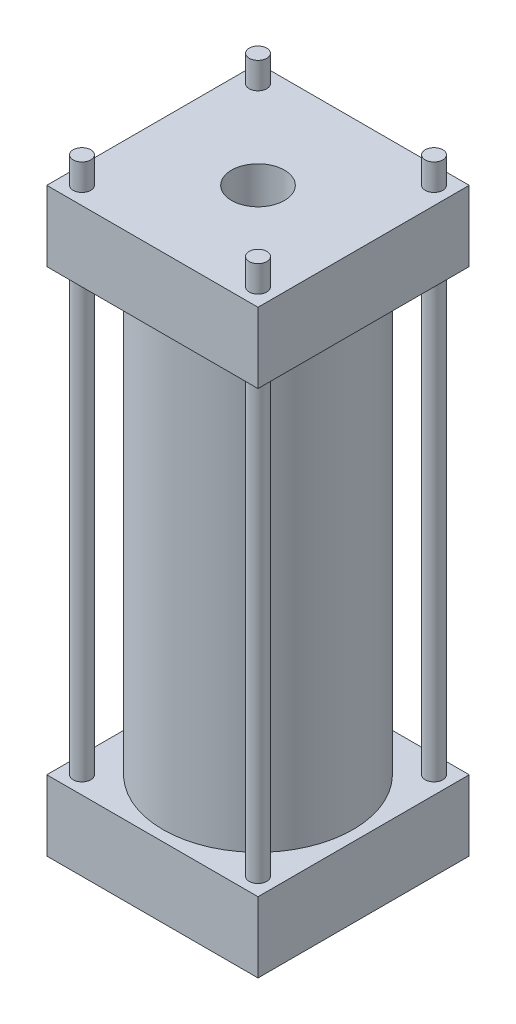
ISO-10303-21;
HEADER;
FILE_DESCRIPTION(('STEP AP214'),'2;1');
FILE_NAME('part.step','',(''),(''),'','','');
FILE_SCHEMA(('AUTOMOTIVE_DESIGN { 1 0 10303 214 1 1 1 1 }'));
ENDSEC;
DATA;
#1=APPLICATION_CONTEXT('core data for automotive mechanical design processes');
#2=APPLICATION_PROTOCOL_DEFINITION('international standard','automotive_design',2000,#1);
#3=PRODUCT_CONTEXT('',#1,'mechanical');
#4=PRODUCT('Part','Part','',(#3));
#5=PRODUCT_RELATED_PRODUCT_CATEGORY('part','',(#4));
#6=PRODUCT_DEFINITION_FORMATION('','',#4);
#7=PRODUCT_DEFINITION_CONTEXT('part definition',#1,'design');
#8=PRODUCT_DEFINITION('design','',#6,#7);
#9=PRODUCT_DEFINITION_SHAPE('','',#8);
#10=(LENGTH_UNIT() NAMED_UNIT(*) SI_UNIT(.MILLI.,.METRE.));
#11=(NAMED_UNIT(*) PLANE_ANGLE_UNIT() SI_UNIT($,.RADIAN.));
#12=(NAMED_UNIT(*) SI_UNIT($,.STERADIAN.) SOLID_ANGLE_UNIT());
#13=UNCERTAINTY_MEASURE_WITH_UNIT(LENGTH_MEASURE(1.E-05),#10,'distance_accuracy_value','');
#14=(GEOMETRIC_REPRESENTATION_CONTEXT(3) GLOBAL_UNCERTAINTY_ASSIGNED_CONTEXT((#13)) GLOBAL_UNIT_ASSIGNED_CONTEXT((#10,
#11,#12)) REPRESENTATION_CONTEXT('',''));
#15=CARTESIAN_POINT('',(0.,0.,0.));
#16=DIRECTION('',(0.,0.,1.));
#17=DIRECTION('',(1.,0.,0.));
#18=AXIS2_PLACEMENT_3D('',#15,#16,#17);
#19=CARTESIAN_POINT('',(0.,0.,0.));
#20=DIRECTION('',(0.,1.,0.));
#21=DIRECTION('',(0.,0.,1.));
#22=AXIS2_PLACEMENT_3D('',#19,#20,#21);
#23=PLANE('',#22);
#24=CARTESIAN_POINT('',(0.,0.,0.));
#25=DIRECTION('',(0.,1.,0.));
#26=DIRECTION('',(0.,0.,1.));
#27=AXIS2_PLACEMENT_3D('',#24,#25,#26);
#28=CIRCLE('',#27,50.);
#29=CARTESIAN_POINT('',(0.,0.,50.));
#30=VERTEX_POINT('',#29);
#31=EDGE_CURVE('E166',#30,#30,#28,.T.);
#32=ORIENTED_EDGE('',*,*,#31,.T.);
#33=EDGE_LOOP('',(#32));
#34=FACE_BOUND('',#33,.T.);
#35=ADVANCED_FACE('F32',(#34),#23,.T.);
#36=CARTESIAN_POINT('',(0.,250.,0.));
#37=DIRECTION('',(0.,-1.,0.));
#38=DIRECTION('',(0.,0.,-1.));
#39=AXIS2_PLACEMENT_3D('',#36,#37,#38);
#40=CYLINDRICAL_SURFACE('',#39,50.);
#41=CARTESIAN_POINT('',(0.,250.,0.));
#42=DIRECTION('',(0.,1.,0.));
#43=DIRECTION('',(0.,0.,1.));
#44=AXIS2_PLACEMENT_3D('',#41,#42,#43);
#45=CIRCLE('',#44,50.);
#46=CARTESIAN_POINT('',(0.,250.,50.));
#47=VERTEX_POINT('',#46);
#48=EDGE_CURVE('E134',#47,#47,#45,.T.);
#49=ORIENTED_EDGE('',*,*,#48,.T.);
#50=EDGE_LOOP('',(#49));
#51=FACE_BOUND('',#50,.T.);
#52=ORIENTED_EDGE('',*,*,#31,.F.);
#53=EDGE_LOOP('',(#52));
#54=FACE_BOUND('',#53,.T.);
#55=ADVANCED_FACE('F237',(#51,#54),#40,.F.);
#56=CARTESIAN_POINT('',(0.,250.,0.));
#57=DIRECTION('',(0.,1.,0.));
#58=DIRECTION('',(0.,0.,1.));
#59=AXIS2_PLACEMENT_3D('',#56,#57,#58);
#60=PLANE('',#59);
#61=CARTESIAN_POINT('',(0.,250.,0.));
#62=DIRECTION('',(0.,1.,0.));
#63=DIRECTION('',(0.,0.,1.));
#64=AXIS2_PLACEMENT_3D('',#61,#62,#63);
#65=CIRCLE('',#64,15.);
#66=CARTESIAN_POINT('',(0.,250.,15.));
#67=VERTEX_POINT('',#66);
#68=EDGE_CURVE('E205',#67,#67,#65,.F.);
#69=ORIENTED_EDGE('',*,*,#68,.F.);
#70=EDGE_LOOP('',(#69));
#71=FACE_BOUND('',#70,.T.);
#72=ORIENTED_EDGE('',*,*,#48,.F.);
#73=EDGE_LOOP('',(#72));
#74=FACE_BOUND('',#73,.T.);
#75=ADVANCED_FACE('F244',(#71,#74),#60,.F.);
#76=CARTESIAN_POINT('',(0.,-40.001,0.));
#77=DIRECTION('',(0.,1.,0.));
#78=DIRECTION('',(0.,0.,1.));
#79=AXIS2_PLACEMENT_3D('',#76,#77,#78);
#80=CYLINDRICAL_SURFACE('',#79,15.);
#81=CARTESIAN_POINT('',(0.,290.,0.));
#82=DIRECTION('',(0.,1.,0.));
#83=DIRECTION('',(0.,0.,1.));
#84=AXIS2_PLACEMENT_3D('',#81,#82,#83);
#85=CIRCLE('',#84,15.);
#86=CARTESIAN_POINT('',(0.,290.,15.));
#87=VERTEX_POINT('',#86);
#88=EDGE_CURVE('E200',#87,#87,#85,.T.);
#89=ORIENTED_EDGE('',*,*,#88,.T.);
#90=EDGE_LOOP('',(#89));
#91=FACE_BOUND('',#90,.T.);
#92=ORIENTED_EDGE('',*,*,#68,.T.);
#93=EDGE_LOOP('',(#92));
#94=FACE_BOUND('',#93,.T.);
#95=ADVANCED_FACE('F258',(#91,#94),#80,.F.);
#96=CARTESIAN_POINT('',(0.,250.,0.));
#97=DIRECTION('',(0.,-1.,0.));
#98=DIRECTION('',(0.,0.,-1.));
#99=AXIS2_PLACEMENT_3D('',#96,#97,#98);
#100=CYLINDRICAL_SURFACE('',#99,54.);
#101=CARTESIAN_POINT('',(0.,250.,0.));
#102=DIRECTION('',(0.,1.,0.));
#103=DIRECTION('',(0.,0.,1.));
#104=AXIS2_PLACEMENT_3D('',#101,#102,#103);
#105=CIRCLE('',#104,54.);
#106=CARTESIAN_POINT('',(0.,250.,54.));
#107=VERTEX_POINT('',#106);
#108=EDGE_CURVE('E169',#107,#107,#105,.T.);
#109=ORIENTED_EDGE('',*,*,#108,.F.);
#110=EDGE_LOOP('',(#109));
#111=FACE_BOUND('',#110,.T.);
#112=CARTESIAN_POINT('',(0.,0.,0.));
#113=DIRECTION('',(0.,1.,0.));
#114=DIRECTION('',(0.,0.,1.));
#115=AXIS2_PLACEMENT_3D('',#112,#113,#114);
#116=CIRCLE('',#115,54.);
#117=CARTESIAN_POINT('',(0.,0.,54.));
#118=VERTEX_POINT('',#117);
#119=EDGE_CURVE('E163',#118,#118,#116,.T.);
#120=ORIENTED_EDGE('',*,*,#119,.T.);
#121=EDGE_LOOP('',(#120));
#122=FACE_BOUND('',#121,.T.);
#123=ADVANCED_FACE('F34',(#111,#122),#100,.T.);
#124=CARTESIAN_POINT('',(50.,0.,50.));
#125=DIRECTION('',(0.,1.,0.));
#126=DIRECTION('',(0.,0.,1.));
#127=AXIS2_PLACEMENT_3D('',#124,#125,#126);
#128=CIRCLE('',#127,5.);
#129=CARTESIAN_POINT('',(50.,0.,55.));
#130=VERTEX_POINT('',#129);
#131=EDGE_CURVE('E11',#130,#130,#128,.T.);
#132=ORIENTED_EDGE('',*,*,#131,.F.);
#133=EDGE_LOOP('',(#132));
#134=FACE_BOUND('',#133,.T.);
#135=CARTESIAN_POINT('',(50.,0.,-50.));
#136=DIRECTION('',(0.,1.,0.));
#137=DIRECTION('',(0.,0.,1.));
#138=AXIS2_PLACEMENT_3D('',#135,#136,#137);
#139=CIRCLE('',#138,5.);
#140=CARTESIAN_POINT('',(50.,0.,-45.));
#141=VERTEX_POINT('',#140);
#142=EDGE_CURVE('E181',#141,#141,#139,.T.);
#143=ORIENTED_EDGE('',*,*,#142,.F.);
#144=EDGE_LOOP('',(#143));
#145=FACE_BOUND('',#144,.T.);
#146=CARTESIAN_POINT('',(-50.,0.,50.));
#147=DIRECTION('',(0.,1.,0.));
#148=DIRECTION('',(0.,0.,1.));
#149=AXIS2_PLACEMENT_3D('',#146,#147,#148);
#150=CIRCLE('',#149,5.);
#151=CARTESIAN_POINT('',(-50.,0.,55.));
#152=VERTEX_POINT('',#151);
#153=EDGE_CURVE('E178',#152,#152,#150,.T.);
#154=ORIENTED_EDGE('',*,*,#153,.F.);
#155=EDGE_LOOP('',(#154));
#156=FACE_BOUND('',#155,.T.);
#157=CARTESIAN_POINT('',(-50.,0.,-50.));
#158=DIRECTION('',(0.,1.,0.));
#159=DIRECTION('',(0.,0.,1.));
#160=AXIS2_PLACEMENT_3D('',#157,#158,#159);
#161=CIRCLE('',#160,5.);
#162=CARTESIAN_POINT('',(-50.,0.,-45.));
#163=VERTEX_POINT('',#162);
#164=EDGE_CURVE('E175',#163,#163,#161,.T.);
#165=ORIENTED_EDGE('',*,*,#164,.F.);
#166=EDGE_LOOP('',(#165));
#167=FACE_BOUND('',#166,.T.);
#168=DIRECTION('',(0.,0.,-1.));
#169=VECTOR('',#168,1.);
#170=CARTESIAN_POINT('',(-60.,0.,60.));
#171=LINE('',#170,#169);
#172=CARTESIAN_POINT('',(-60.,0.,60.));
#173=VERTEX_POINT('',#172);
#174=CARTESIAN_POINT('',(-60.,0.,-60.));
#175=VERTEX_POINT('',#174);
#176=EDGE_CURVE('E137',#173,#175,#171,.T.);
#177=ORIENTED_EDGE('',*,*,#176,.F.);
#178=DIRECTION('',(-1.,0.,0.));
#179=VECTOR('',#178,1.);
#180=CARTESIAN_POINT('',(60.,0.,60.));
#181=LINE('',#180,#179);
#182=CARTESIAN_POINT('',(60.,0.,60.));
#183=VERTEX_POINT('',#182);
#184=EDGE_CURVE('E74',#183,#173,#181,.T.);
#185=ORIENTED_EDGE('',*,*,#184,.F.);
#186=DIRECTION('',(0.,0.,1.));
#187=VECTOR('',#186,1.);
#188=CARTESIAN_POINT('',(60.,0.,60.));
#189=LINE('',#188,#187);
#190=CARTESIAN_POINT('',(60.,0.,-60.));
#191=VERTEX_POINT('',#190);
#192=EDGE_CURVE('E68',#191,#183,#189,.T.);
#193=ORIENTED_EDGE('',*,*,#192,.F.);
#194=DIRECTION('',(1.,0.,0.));
#195=VECTOR('',#194,1.);
#196=CARTESIAN_POINT('',(60.,0.,-60.));
#197=LINE('',#196,#195);
#198=EDGE_CURVE('E152',#175,#191,#197,.T.);
#199=ORIENTED_EDGE('',*,*,#198,.F.);
#200=EDGE_LOOP('',(#177,#185,#193,#199));
#201=FACE_BOUND('',#200,.T.);
#202=ORIENTED_EDGE('',*,*,#119,.F.);
#203=EDGE_LOOP('',(#202));
#204=FACE_BOUND('',#203,.T.);
#205=ADVANCED_FACE('F240',(#134,#145,#156,#167,#201,#204),#23,.T.);
#206=CARTESIAN_POINT('',(-60.,-40.,60.));
#207=DIRECTION('',(1.,0.,0.));
#208=DIRECTION('',(0.,0.,-1.));
#209=AXIS2_PLACEMENT_3D('',#206,#207,#208);
#210=PLANE('',#209);
#211=ORIENTED_EDGE('',*,*,#176,.T.);
#212=DIRECTION('',(0.,1.,0.));
#213=VECTOR('',#212,1.);
#214=CARTESIAN_POINT('',(-60.,-40.,-60.));
#215=LINE('',#214,#213);
#216=CARTESIAN_POINT('',(-60.,-40.,-60.));
#217=VERTEX_POINT('',#216);
#218=EDGE_CURVE('E161',#217,#175,#215,.T.);
#219=ORIENTED_EDGE('',*,*,#218,.F.);
#220=DIRECTION('',(0.,0.,-1.));
#221=VECTOR('',#220,1.);
#222=CARTESIAN_POINT('',(-60.,-40.,60.));
#223=LINE('',#222,#221);
#224=CARTESIAN_POINT('',(-60.,-40.,60.));
#225=VERTEX_POINT('',#224);
#226=EDGE_CURVE('E143',#225,#217,#223,.T.);
#227=ORIENTED_EDGE('',*,*,#226,.F.);
#228=DIRECTION('',(0.,1.,0.));
#229=VECTOR('',#228,1.);
#230=CARTESIAN_POINT('',(-60.,-40.,60.));
#231=LINE('',#230,#229);
#232=EDGE_CURVE('E149',#225,#173,#231,.T.);
#233=ORIENTED_EDGE('',*,*,#232,.T.);
#234=EDGE_LOOP('',(#211,#219,#227,#233));
#235=FACE_BOUND('',#234,.T.);
#236=ADVANCED_FACE('F249',(#235),#210,.F.);
#237=CARTESIAN_POINT('',(60.,-40.,-60.));
#238=DIRECTION('',(0.,0.,1.));
#239=DIRECTION('',(1.,0.,0.));
#240=AXIS2_PLACEMENT_3D('',#237,#238,#239);
#241=PLANE('',#240);
#242=ORIENTED_EDGE('',*,*,#198,.T.);
#243=DIRECTION('',(0.,1.,0.));
#244=VECTOR('',#243,1.);
#245=CARTESIAN_POINT('',(60.,-40.,-60.));
#246=LINE('',#245,#244);
#247=CARTESIAN_POINT('',(60.,-40.,-60.));
#248=VERTEX_POINT('',#247);
#249=EDGE_CURVE('E159',#248,#191,#246,.T.);
#250=ORIENTED_EDGE('',*,*,#249,.F.);
#251=DIRECTION('',(1.,0.,0.));
#252=VECTOR('',#251,1.);
#253=CARTESIAN_POINT('',(60.,-40.,-60.));
#254=LINE('',#253,#252);
#255=EDGE_CURVE('E82',#217,#248,#254,.T.);
#256=ORIENTED_EDGE('',*,*,#255,.F.);
#257=ORIENTED_EDGE('',*,*,#218,.T.);
#258=EDGE_LOOP('',(#242,#250,#256,#257));
#259=FACE_BOUND('',#258,.T.);
#260=ADVANCED_FACE('F255',(#259),#241,.F.);
#261=CARTESIAN_POINT('',(60.,-40.,60.));
#262=DIRECTION('',(-1.,0.,0.));
#263=DIRECTION('',(0.,0.,1.));
#264=AXIS2_PLACEMENT_3D('',#261,#262,#263);
#265=PLANE('',#264);
#266=ORIENTED_EDGE('',*,*,#192,.T.);
#267=DIRECTION('',(0.,1.,0.));
#268=VECTOR('',#267,1.);
#269=CARTESIAN_POINT('',(60.,-40.,60.));
#270=LINE('',#269,#268);
#271=CARTESIAN_POINT('',(60.,-40.,60.));
#272=VERTEX_POINT('',#271);
#273=EDGE_CURVE('E157',#272,#183,#270,.T.);
#274=ORIENTED_EDGE('',*,*,#273,.F.);
#275=DIRECTION('',(0.,0.,1.));
#276=VECTOR('',#275,1.);
#277=CARTESIAN_POINT('',(60.,-40.,60.));
#278=LINE('',#277,#276);
#279=EDGE_CURVE('E146',#248,#272,#278,.T.);
#280=ORIENTED_EDGE('',*,*,#279,.F.);
#281=ORIENTED_EDGE('',*,*,#249,.T.);
#282=EDGE_LOOP('',(#266,#274,#280,#281));
#283=FACE_BOUND('',#282,.T.);
#284=ADVANCED_FACE('F275',(#283),#265,.F.);
#285=CARTESIAN_POINT('',(60.,-40.,60.));
#286=DIRECTION('',(0.,0.,-1.));
#287=DIRECTION('',(-1.,0.,0.));
#288=AXIS2_PLACEMENT_3D('',#285,#286,#287);
#289=PLANE('',#288);
#290=ORIENTED_EDGE('',*,*,#184,.T.);
#291=ORIENTED_EDGE('',*,*,#232,.F.);
#292=DIRECTION('',(-1.,0.,0.));
#293=VECTOR('',#292,1.);
#294=CARTESIAN_POINT('',(60.,-40.,60.));
#295=LINE('',#294,#293);
#296=EDGE_CURVE('E50',#272,#225,#295,.T.);
#297=ORIENTED_EDGE('',*,*,#296,.F.);
#298=ORIENTED_EDGE('',*,*,#273,.T.);
#299=EDGE_LOOP('',(#290,#291,#297,#298));
#300=FACE_BOUND('',#299,.T.);
#301=ADVANCED_FACE('F273',(#300),#289,.F.);
#302=CARTESIAN_POINT('',(0.,-40.,0.));
#303=DIRECTION('',(0.,1.,0.));
#304=DIRECTION('',(0.,0.,1.));
#305=AXIS2_PLACEMENT_3D('',#302,#303,#304);
#306=PLANE('',#305);
#307=ORIENTED_EDGE('',*,*,#226,.T.);
#308=ORIENTED_EDGE('',*,*,#255,.T.);
#309=ORIENTED_EDGE('',*,*,#279,.T.);
#310=ORIENTED_EDGE('',*,*,#296,.T.);
#311=EDGE_LOOP('',(#307,#308,#309,#310));
#312=FACE_BOUND('',#311,.T.);
#313=ADVANCED_FACE('F276',(#312),#306,.F.);
#314=CARTESIAN_POINT('',(50.,250.,50.));
#315=DIRECTION('',(0.,1.,0.));
#316=DIRECTION('',(0.,0.,1.));
#317=AXIS2_PLACEMENT_3D('',#314,#315,#316);
#318=CIRCLE('',#317,5.);
#319=CARTESIAN_POINT('',(50.,250.,55.));
#320=VERTEX_POINT('',#319);
#321=EDGE_CURVE('E470',#320,#320,#318,.T.);
#322=ORIENTED_EDGE('',*,*,#321,.T.);
#323=EDGE_LOOP('',(#322));
#324=FACE_BOUND('',#323,.T.);
#325=CARTESIAN_POINT('',(50.,250.,-50.));
#326=DIRECTION('',(0.,1.,0.));
#327=DIRECTION('',(0.,0.,1.));
#328=AXIS2_PLACEMENT_3D('',#325,#326,#327);
#329=CIRCLE('',#328,5.);
#330=CARTESIAN_POINT('',(50.,250.,-45.));
#331=VERTEX_POINT('',#330);
#332=EDGE_CURVE('E475',#331,#331,#329,.T.);
#333=ORIENTED_EDGE('',*,*,#332,.T.);
#334=EDGE_LOOP('',(#333));
#335=FACE_BOUND('',#334,.T.);
#336=CARTESIAN_POINT('',(-50.,250.,50.));
#337=DIRECTION('',(0.,1.,0.));
#338=DIRECTION('',(0.,0.,1.));
#339=AXIS2_PLACEMENT_3D('',#336,#337,#338);
#340=CIRCLE('',#339,5.);
#341=CARTESIAN_POINT('',(-50.,250.,55.));
#342=VERTEX_POINT('',#341);
#343=EDGE_CURVE('E192',#342,#342,#340,.T.);
#344=ORIENTED_EDGE('',*,*,#343,.T.);
#345=EDGE_LOOP('',(#344));
#346=FACE_BOUND('',#345,.T.);
#347=CARTESIAN_POINT('',(-50.,250.,-50.));
#348=DIRECTION('',(0.,1.,0.));
#349=DIRECTION('',(0.,0.,1.));
#350=AXIS2_PLACEMENT_3D('',#347,#348,#349);
#351=CIRCLE('',#350,5.);
#352=CARTESIAN_POINT('',(-50.,250.,-45.));
#353=VERTEX_POINT('',#352);
#354=EDGE_CURVE('E197',#353,#353,#351,.T.);
#355=ORIENTED_EDGE('',*,*,#354,.T.);
#356=EDGE_LOOP('',(#355));
#357=FACE_BOUND('',#356,.T.);
#358=DIRECTION('',(-1.,0.,0.));
#359=VECTOR('',#358,1.);
#360=CARTESIAN_POINT('',(60.,250.,-60.));
#361=LINE('',#360,#359);
#362=CARTESIAN_POINT('',(60.,250.,-60.));
#363=VERTEX_POINT('',#362);
#364=CARTESIAN_POINT('',(-60.,250.,-60.));
#365=VERTEX_POINT('',#364);
#366=EDGE_CURVE('E133',#363,#365,#361,.T.);
#367=ORIENTED_EDGE('',*,*,#366,.F.);
#368=DIRECTION('',(0.,0.,-1.));
#369=VECTOR('',#368,1.);
#370=CARTESIAN_POINT('',(60.,250.,60.));
#371=LINE('',#370,#369);
#372=CARTESIAN_POINT('',(60.,250.,60.));
#373=VERTEX_POINT('',#372);
#374=EDGE_CURVE('E129',#373,#363,#371,.T.);
#375=ORIENTED_EDGE('',*,*,#374,.F.);
#376=DIRECTION('',(1.,0.,0.));
#377=VECTOR('',#376,1.);
#378=CARTESIAN_POINT('',(-60.,250.,60.));
#379=LINE('',#378,#377);
#380=CARTESIAN_POINT('',(-60.,250.,60.));
#381=VERTEX_POINT('',#380);
#382=EDGE_CURVE('E214',#381,#373,#379,.T.);
#383=ORIENTED_EDGE('',*,*,#382,.F.);
#384=DIRECTION('',(0.,0.,1.));
#385=VECTOR('',#384,1.);
#386=CARTESIAN_POINT('',(-60.,250.,-60.));
#387=LINE('',#386,#385);
#388=EDGE_CURVE('E212',#365,#381,#387,.T.);
#389=ORIENTED_EDGE('',*,*,#388,.F.);
#390=EDGE_LOOP('',(#367,#375,#383,#389));
#391=FACE_BOUND('',#390,.T.);
#392=ORIENTED_EDGE('',*,*,#108,.T.);
#393=EDGE_LOOP('',(#392));
#394=FACE_BOUND('',#393,.T.);
#395=ADVANCED_FACE('F225',(#324,#335,#346,#357,#391,#394),#60,.F.);
#396=CARTESIAN_POINT('',(60.,290.,-60.));
#397=DIRECTION('',(0.,0.,1.));
#398=DIRECTION('',(1.,0.,0.));
#399=AXIS2_PLACEMENT_3D('',#396,#397,#398);
#400=PLANE('',#399);
#401=ORIENTED_EDGE('',*,*,#366,.T.);
#402=DIRECTION('',(0.,-1.,0.));
#403=VECTOR('',#402,1.);
#404=CARTESIAN_POINT('',(-60.,290.,-60.));
#405=LINE('',#404,#403);
#406=CARTESIAN_POINT('',(-60.,290.,-60.));
#407=VERTEX_POINT('',#406);
#408=EDGE_CURVE('E113',#407,#365,#405,.T.);
#409=ORIENTED_EDGE('',*,*,#408,.F.);
#410=DIRECTION('',(-1.,0.,0.));
#411=VECTOR('',#410,1.);
#412=CARTESIAN_POINT('',(60.,290.,-60.));
#413=LINE('',#412,#411);
#414=CARTESIAN_POINT('',(60.,290.,-60.));
#415=VERTEX_POINT('',#414);
#416=EDGE_CURVE('E120',#415,#407,#413,.T.);
#417=ORIENTED_EDGE('',*,*,#416,.F.);
#418=DIRECTION('',(0.,-1.,0.));
#419=VECTOR('',#418,1.);
#420=CARTESIAN_POINT('',(60.,290.,-60.));
#421=LINE('',#420,#419);
#422=EDGE_CURVE('E210',#415,#363,#421,.T.);
#423=ORIENTED_EDGE('',*,*,#422,.T.);
#424=EDGE_LOOP('',(#401,#409,#417,#423));
#425=FACE_BOUND('',#424,.T.);
#426=ADVANCED_FACE('F131',(#425),#400,.F.);
#427=CARTESIAN_POINT('',(-60.,290.,-60.));
#428=DIRECTION('',(1.,0.,0.));
#429=DIRECTION('',(0.,0.,-1.));
#430=AXIS2_PLACEMENT_3D('',#427,#428,#429);
#431=PLANE('',#430);
#432=ORIENTED_EDGE('',*,*,#388,.T.);
#433=DIRECTION('',(0.,-1.,0.));
#434=VECTOR('',#433,1.);
#435=CARTESIAN_POINT('',(-60.,290.,60.));
#436=LINE('',#435,#434);
#437=CARTESIAN_POINT('',(-60.,290.,60.));
#438=VERTEX_POINT('',#437);
#439=EDGE_CURVE('E116',#438,#381,#436,.T.);
#440=ORIENTED_EDGE('',*,*,#439,.F.);
#441=DIRECTION('',(0.,0.,1.));
#442=VECTOR('',#441,1.);
#443=CARTESIAN_POINT('',(-60.,290.,-60.));
#444=LINE('',#443,#442);
#445=EDGE_CURVE('E109',#407,#438,#444,.T.);
#446=ORIENTED_EDGE('',*,*,#445,.F.);
#447=ORIENTED_EDGE('',*,*,#408,.T.);
#448=EDGE_LOOP('',(#432,#440,#446,#447));
#449=FACE_BOUND('',#448,.T.);
#450=ADVANCED_FACE('F111',(#449),#431,.F.);
#451=CARTESIAN_POINT('',(-60.,290.,60.));
#452=DIRECTION('',(0.,0.,-1.));
#453=DIRECTION('',(-1.,0.,0.));
#454=AXIS2_PLACEMENT_3D('',#451,#452,#453);
#455=PLANE('',#454);
#456=ORIENTED_EDGE('',*,*,#382,.T.);
#457=DIRECTION('',(0.,-1.,0.));
#458=VECTOR('',#457,1.);
#459=CARTESIAN_POINT('',(60.,290.,60.));
#460=LINE('',#459,#458);
#461=CARTESIAN_POINT('',(60.,290.,60.));
#462=VERTEX_POINT('',#461);
#463=EDGE_CURVE('E139',#462,#373,#460,.T.);
#464=ORIENTED_EDGE('',*,*,#463,.F.);
#465=DIRECTION('',(1.,0.,0.));
#466=VECTOR('',#465,1.);
#467=CARTESIAN_POINT('',(-60.,290.,60.));
#468=LINE('',#467,#466);
#469=EDGE_CURVE('E119',#438,#462,#468,.T.);
#470=ORIENTED_EDGE('',*,*,#469,.F.);
#471=ORIENTED_EDGE('',*,*,#439,.T.);
#472=EDGE_LOOP('',(#456,#464,#470,#471));
#473=FACE_BOUND('',#472,.T.);
#474=ADVANCED_FACE('F227',(#473),#455,.F.);
#475=CARTESIAN_POINT('',(60.,290.,60.));
#476=DIRECTION('',(-1.,0.,0.));
#477=DIRECTION('',(0.,0.,1.));
#478=AXIS2_PLACEMENT_3D('',#475,#476,#477);
#479=PLANE('',#478);
#480=ORIENTED_EDGE('',*,*,#374,.T.);
#481=ORIENTED_EDGE('',*,*,#422,.F.);
#482=DIRECTION('',(0.,0.,-1.));
#483=VECTOR('',#482,1.);
#484=CARTESIAN_POINT('',(60.,290.,60.));
#485=LINE('',#484,#483);
#486=EDGE_CURVE('E125',#462,#415,#485,.T.);
#487=ORIENTED_EDGE('',*,*,#486,.F.);
#488=ORIENTED_EDGE('',*,*,#463,.T.);
#489=EDGE_LOOP('',(#480,#481,#487,#488));
#490=FACE_BOUND('',#489,.T.);
#491=ADVANCED_FACE('F221',(#490),#479,.F.);
#492=CARTESIAN_POINT('',(0.,290.,0.));
#493=DIRECTION('',(0.,1.,0.));
#494=DIRECTION('',(0.,0.,1.));
#495=AXIS2_PLACEMENT_3D('',#492,#493,#494);
#496=PLANE('',#495);
#497=CARTESIAN_POINT('',(50.,290.,50.));
#498=DIRECTION('',(0.,1.,0.));
#499=DIRECTION('',(0.,0.,1.));
#500=AXIS2_PLACEMENT_3D('',#497,#498,#499);
#501=CIRCLE('',#500,5.);
#502=CARTESIAN_POINT('',(50.,290.,55.));
#503=VERTEX_POINT('',#502);
#504=EDGE_CURVE('E36',#503,#503,#501,.T.);
#505=ORIENTED_EDGE('',*,*,#504,.F.);
#506=EDGE_LOOP('',(#505));
#507=FACE_BOUND('',#506,.T.);
#508=CARTESIAN_POINT('',(50.,290.,-50.));
#509=DIRECTION('',(0.,1.,0.));
#510=DIRECTION('',(0.,0.,1.));
#511=AXIS2_PLACEMENT_3D('',#508,#509,#510);
#512=CIRCLE('',#511,5.);
#513=CARTESIAN_POINT('',(50.,290.,-45.));
#514=VERTEX_POINT('',#513);
#515=EDGE_CURVE('E179',#514,#514,#512,.T.);
#516=ORIENTED_EDGE('',*,*,#515,.F.);
#517=EDGE_LOOP('',(#516));
#518=FACE_BOUND('',#517,.T.);
#519=CARTESIAN_POINT('',(-50.,290.,50.));
#520=DIRECTION('',(0.,1.,0.));
#521=DIRECTION('',(0.,0.,1.));
#522=AXIS2_PLACEMENT_3D('',#519,#520,#521);
#523=CIRCLE('',#522,5.);
#524=CARTESIAN_POINT('',(-50.,290.,55.));
#525=VERTEX_POINT('',#524);
#526=EDGE_CURVE('E176',#525,#525,#523,.T.);
#527=ORIENTED_EDGE('',*,*,#526,.F.);
#528=EDGE_LOOP('',(#527));
#529=FACE_BOUND('',#528,.T.);
#530=CARTESIAN_POINT('',(-50.,290.,-50.));
#531=DIRECTION('',(0.,1.,0.));
#532=DIRECTION('',(0.,0.,1.));
#533=AXIS2_PLACEMENT_3D('',#530,#531,#532);
#534=CIRCLE('',#533,5.);
#535=CARTESIAN_POINT('',(-50.,290.,-45.));
#536=VERTEX_POINT('',#535);
#537=EDGE_CURVE('E172',#536,#536,#534,.T.);
#538=ORIENTED_EDGE('',*,*,#537,.F.);
#539=EDGE_LOOP('',(#538));
#540=FACE_BOUND('',#539,.T.);
#541=ORIENTED_EDGE('',*,*,#88,.F.);
#542=EDGE_LOOP('',(#541));
#543=FACE_BOUND('',#542,.T.);
#544=ORIENTED_EDGE('',*,*,#416,.T.);
#545=ORIENTED_EDGE('',*,*,#445,.T.);
#546=ORIENTED_EDGE('',*,*,#469,.T.);
#547=ORIENTED_EDGE('',*,*,#486,.T.);
#548=EDGE_LOOP('',(#544,#545,#546,#547));
#549=FACE_BOUND('',#548,.T.);
#550=ADVANCED_FACE('F123',(#507,#518,#529,#540,#543,#549),#496,.T.);
#551=CARTESIAN_POINT('',(-50.,305.,-50.));
#552=DIRECTION('',(0.,1.,0.));
#553=DIRECTION('',(0.,0.,1.));
#554=AXIS2_PLACEMENT_3D('',#551,#552,#553);
#555=PLANE('',#554);
#556=CARTESIAN_POINT('',(-50.,305.,-50.));
#557=DIRECTION('',(0.,1.,0.));
#558=DIRECTION('',(0.,0.,1.));
#559=AXIS2_PLACEMENT_3D('',#556,#557,#558);
#560=CIRCLE('',#559,5.);
#561=CARTESIAN_POINT('',(-50.,305.,-45.));
#562=VERTEX_POINT('',#561);
#563=EDGE_CURVE('E194',#562,#562,#560,.T.);
#564=ORIENTED_EDGE('',*,*,#563,.T.);
#565=EDGE_LOOP('',(#564));
#566=FACE_BOUND('',#565,.T.);
#567=ADVANCED_FACE('F337',(#566),#555,.T.);
#568=CARTESIAN_POINT('',(-50.,-5.,-50.));
#569=DIRECTION('',(0.,1.,0.));
#570=DIRECTION('',(0.,0.,1.));
#571=AXIS2_PLACEMENT_3D('',#568,#569,#570);
#572=CYLINDRICAL_SURFACE('',#571,5.);
#573=ORIENTED_EDGE('',*,*,#537,.T.);
#574=EDGE_LOOP('',(#573));
#575=FACE_BOUND('',#574,.T.);
#576=ORIENTED_EDGE('',*,*,#563,.F.);
#577=EDGE_LOOP('',(#576));
#578=FACE_BOUND('',#577,.T.);
#579=ADVANCED_FACE('F341',(#575,#578),#572,.T.);
#580=ORIENTED_EDGE('',*,*,#164,.T.);
#581=EDGE_LOOP('',(#580));
#582=FACE_BOUND('',#581,.T.);
#583=ORIENTED_EDGE('',*,*,#354,.F.);
#584=EDGE_LOOP('',(#583));
#585=FACE_BOUND('',#584,.T.);
#586=ADVANCED_FACE('F351',(#582,#585),#572,.T.);
#587=CARTESIAN_POINT('',(-50.,305.,50.));
#588=DIRECTION('',(0.,1.,0.));
#589=DIRECTION('',(0.,0.,1.));
#590=AXIS2_PLACEMENT_3D('',#587,#588,#589);
#591=PLANE('',#590);
#592=CARTESIAN_POINT('',(-50.,305.,50.));
#593=DIRECTION('',(0.,1.,0.));
#594=DIRECTION('',(0.,0.,1.));
#595=AXIS2_PLACEMENT_3D('',#592,#593,#594);
#596=CIRCLE('',#595,5.);
#597=CARTESIAN_POINT('',(-50.,305.,55.));
#598=VERTEX_POINT('',#597);
#599=EDGE_CURVE('E481',#598,#598,#596,.T.);
#600=ORIENTED_EDGE('',*,*,#599,.T.);
#601=EDGE_LOOP('',(#600));
#602=FACE_BOUND('',#601,.T.);
#603=ADVANCED_FACE('F360',(#602),#591,.T.);
#604=CARTESIAN_POINT('',(-50.,-5.,50.));
#605=DIRECTION('',(0.,1.,0.));
#606=DIRECTION('',(0.,0.,1.));
#607=AXIS2_PLACEMENT_3D('',#604,#605,#606);
#608=CYLINDRICAL_SURFACE('',#607,5.);
#609=ORIENTED_EDGE('',*,*,#526,.T.);
#610=EDGE_LOOP('',(#609));
#611=FACE_BOUND('',#610,.T.);
#612=ORIENTED_EDGE('',*,*,#599,.F.);
#613=EDGE_LOOP('',(#612));
#614=FACE_BOUND('',#613,.T.);
#615=ADVANCED_FACE('F388',(#611,#614),#608,.T.);
#616=ORIENTED_EDGE('',*,*,#153,.T.);
#617=EDGE_LOOP('',(#616));
#618=FACE_BOUND('',#617,.T.);
#619=ORIENTED_EDGE('',*,*,#343,.F.);
#620=EDGE_LOOP('',(#619));
#621=FACE_BOUND('',#620,.T.);
#622=ADVANCED_FACE('F398',(#618,#621),#608,.T.);
#623=CARTESIAN_POINT('',(50.,305.,-50.));
#624=DIRECTION('',(0.,1.,0.));
#625=DIRECTION('',(0.,0.,1.));
#626=AXIS2_PLACEMENT_3D('',#623,#624,#625);
#627=PLANE('',#626);
#628=CARTESIAN_POINT('',(50.,305.,-50.));
#629=DIRECTION('',(0.,1.,0.));
#630=DIRECTION('',(0.,0.,1.));
#631=AXIS2_PLACEMENT_3D('',#628,#629,#630);
#632=CIRCLE('',#631,5.);
#633=CARTESIAN_POINT('',(50.,305.,-45.));
#634=VERTEX_POINT('',#633);
#635=EDGE_CURVE('E471',#634,#634,#632,.T.);
#636=ORIENTED_EDGE('',*,*,#635,.T.);
#637=EDGE_LOOP('',(#636));
#638=FACE_BOUND('',#637,.T.);
#639=ADVANCED_FACE('F408',(#638),#627,.T.);
#640=CARTESIAN_POINT('',(50.,-5.,-50.));
#641=DIRECTION('',(0.,1.,0.));
#642=DIRECTION('',(0.,0.,1.));
#643=AXIS2_PLACEMENT_3D('',#640,#641,#642);
#644=CYLINDRICAL_SURFACE('',#643,5.);
#645=ORIENTED_EDGE('',*,*,#515,.T.);
#646=EDGE_LOOP('',(#645));
#647=FACE_BOUND('',#646,.T.);
#648=ORIENTED_EDGE('',*,*,#635,.F.);
#649=EDGE_LOOP('',(#648));
#650=FACE_BOUND('',#649,.T.);
#651=ADVANCED_FACE('F416',(#647,#650),#644,.T.);
#652=ORIENTED_EDGE('',*,*,#142,.T.);
#653=EDGE_LOOP('',(#652));
#654=FACE_BOUND('',#653,.T.);
#655=ORIENTED_EDGE('',*,*,#332,.F.);
#656=EDGE_LOOP('',(#655));
#657=FACE_BOUND('',#656,.T.);
#658=ADVANCED_FACE('F426',(#654,#657),#644,.T.);
#659=CARTESIAN_POINT('',(50.,305.,50.));
#660=DIRECTION('',(0.,1.,0.));
#661=DIRECTION('',(0.,0.,1.));
#662=AXIS2_PLACEMENT_3D('',#659,#660,#661);
#663=PLANE('',#662);
#664=CARTESIAN_POINT('',(50.,305.,50.));
#665=DIRECTION('',(0.,1.,0.));
#666=DIRECTION('',(0.,0.,1.));
#667=AXIS2_PLACEMENT_3D('',#664,#665,#666);
#668=CIRCLE('',#667,5.);
#669=CARTESIAN_POINT('',(50.,305.,55.));
#670=VERTEX_POINT('',#669);
#671=EDGE_CURVE('E472',#670,#670,#668,.T.);
#672=ORIENTED_EDGE('',*,*,#671,.T.);
#673=EDGE_LOOP('',(#672));
#674=FACE_BOUND('',#673,.T.);
#675=ADVANCED_FACE('F435',(#674),#663,.T.);
#676=CARTESIAN_POINT('',(50.,-5.,50.));
#677=DIRECTION('',(0.,1.,0.));
#678=DIRECTION('',(0.,0.,1.));
#679=AXIS2_PLACEMENT_3D('',#676,#677,#678);
#680=CYLINDRICAL_SURFACE('',#679,5.);
#681=ORIENTED_EDGE('',*,*,#504,.T.);
#682=EDGE_LOOP('',(#681));
#683=FACE_BOUND('',#682,.T.);
#684=ORIENTED_EDGE('',*,*,#671,.F.);
#685=EDGE_LOOP('',(#684));
#686=FACE_BOUND('',#685,.T.);
#687=ADVANCED_FACE('F444',(#683,#686),#680,.T.);
#688=ORIENTED_EDGE('',*,*,#131,.T.);
#689=EDGE_LOOP('',(#688));
#690=FACE_BOUND('',#689,.T.);
#691=ORIENTED_EDGE('',*,*,#321,.F.);
#692=EDGE_LOOP('',(#691));
#693=FACE_BOUND('',#692,.T.);
#694=ADVANCED_FACE('F454',(#690,#693),#680,.T.);
#695=CLOSED_SHELL('',(#35,#55,#75,#95,#123,#205,#236,#260,#284,#301,#313,#395,#426,#450,#474,
#491,#550,#567,#579,#586,#603,#615,#622,#639,#651,#658,#675,#687,#694));
#696=MANIFOLD_SOLID_BREP('B2',#695);
#697=ADVANCED_BREP_SHAPE_REPRESENTATION('',(#18,#696),#14);
#698=SHAPE_DEFINITION_REPRESENTATION(#9,#697);
ENDSEC;
END-ISO-10303-21;
